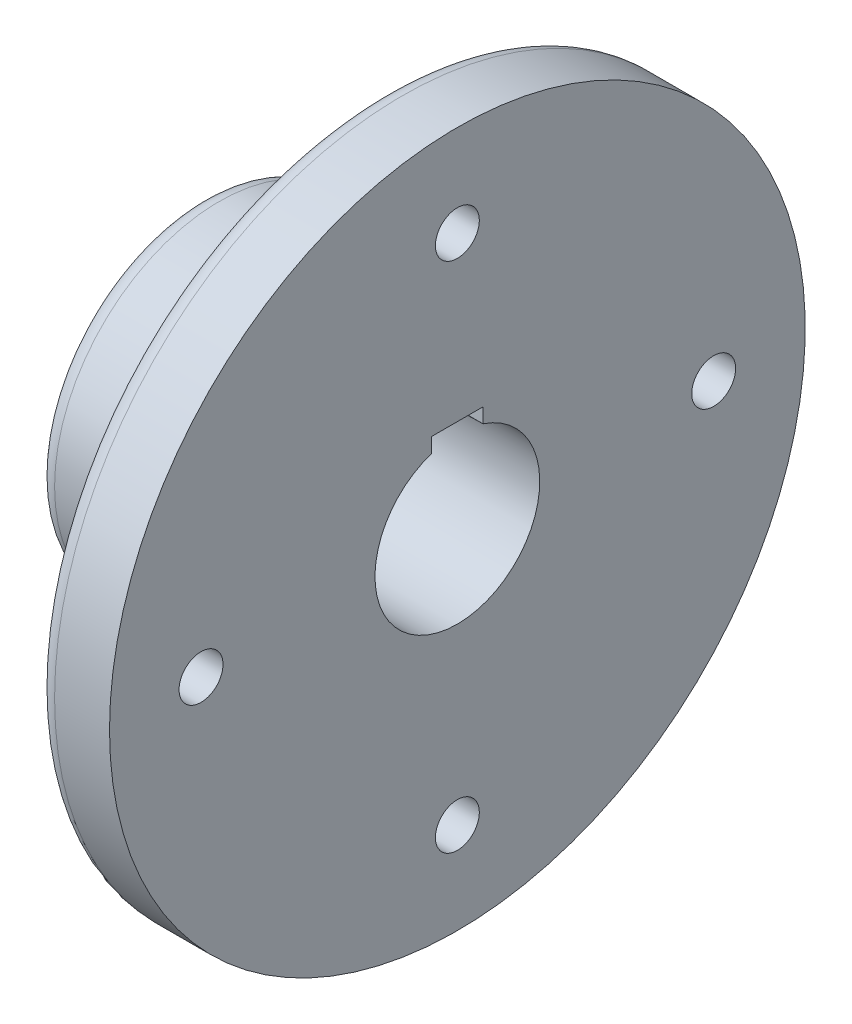
ISO-10303-21;
HEADER;
FILE_DESCRIPTION(('STEP AP214'),'2;1');
FILE_NAME('part.step','',(''),(''),'','','');
FILE_SCHEMA(('AUTOMOTIVE_DESIGN { 1 0 10303 214 1 1 1 1 }'));
ENDSEC;
DATA;
#1=APPLICATION_CONTEXT('core data for automotive mechanical design processes');
#2=APPLICATION_PROTOCOL_DEFINITION('international standard','automotive_design',2000,#1);
#3=PRODUCT_CONTEXT('',#1,'mechanical');
#4=PRODUCT('Part','Part','',(#3));
#5=PRODUCT_RELATED_PRODUCT_CATEGORY('part','',(#4));
#6=PRODUCT_DEFINITION_FORMATION('','',#4);
#7=PRODUCT_DEFINITION_CONTEXT('part definition',#1,'design');
#8=PRODUCT_DEFINITION('design','',#6,#7);
#9=PRODUCT_DEFINITION_SHAPE('','',#8);
#10=(LENGTH_UNIT() NAMED_UNIT(*) SI_UNIT(.MILLI.,.METRE.));
#11=(NAMED_UNIT(*) PLANE_ANGLE_UNIT() SI_UNIT($,.RADIAN.));
#12=(NAMED_UNIT(*) SI_UNIT($,.STERADIAN.) SOLID_ANGLE_UNIT());
#13=UNCERTAINTY_MEASURE_WITH_UNIT(LENGTH_MEASURE(1.E-05),#10,'distance_accuracy_value','');
#14=(GEOMETRIC_REPRESENTATION_CONTEXT(3) GLOBAL_UNCERTAINTY_ASSIGNED_CONTEXT((#13)) GLOBAL_UNIT_ASSIGNED_CONTEXT((#10,
#11,#12)) REPRESENTATION_CONTEXT('',''));
#15=CARTESIAN_POINT('',(0.,0.,0.));
#16=DIRECTION('',(0.,0.,1.));
#17=DIRECTION('',(1.,0.,0.));
#18=AXIS2_PLACEMENT_3D('',#15,#16,#17);
#19=CARTESIAN_POINT('',(0.,0.,0.));
#20=DIRECTION('',(1.,0.,0.));
#21=DIRECTION('',(0.,0.,-1.));
#22=AXIS2_PLACEMENT_3D('',#19,#20,#21);
#23=PLANE('',#22);
#24=DIRECTION('',(0.,-1.,0.));
#25=VECTOR('',#24,1.);
#26=CARTESIAN_POINT('',(0.,0.,-38.696409346288));
#27=LINE('',#26,#25);
#28=CARTESIAN_POINT('',(0.,24.703590653712,-38.696409346288));
#29=VERTEX_POINT('',#28);
#30=CARTESIAN_POINT('',(0.,21.9858428647257,-38.696409346288));
#31=VERTEX_POINT('',#30);
#32=EDGE_CURVE('E150',#29,#31,#27,.T.);
#33=ORIENTED_EDGE('',*,*,#32,.T.);
#34=DIRECTION('',(0.,0.00706473150833643,-0.999975044472968));
#35=VECTOR('',#34,1.);
#36=CARTESIAN_POINT('',(0.,21.7113726217935,0.153388846149928));
#37=LINE('',#36,#35);
#38=CARTESIAN_POINT('',(0.,21.9969517645523,-40.2688148347419));
#39=VERTEX_POINT('',#38);
#40=EDGE_CURVE('E148',#31,#39,#37,.T.);
#41=ORIENTED_EDGE('',*,*,#40,.T.);
#42=CARTESIAN_POINT('',(0.,0.,-45.));
#43=DIRECTION('',(-1.,0.,0.));
#44=DIRECTION('',(0.,0.,1.));
#45=AXIS2_PLACEMENT_3D('',#42,#43,#44);
#46=CIRCLE('',#45,22.5);
#47=CARTESIAN_POINT('',(0.,22.0616034474162,-49.4199155341426));
#48=VERTEX_POINT('',#47);
#49=EDGE_CURVE('E116',#48,#39,#46,.T.);
#50=ORIENTED_EDGE('',*,*,#49,.F.);
#51=CARTESIAN_POINT('',(0.,22.0749114384928,-51.303590653712));
#52=VERTEX_POINT('',#51);
#53=EDGE_CURVE('E61',#48,#52,#37,.T.);
#54=ORIENTED_EDGE('',*,*,#53,.T.);
#55=DIRECTION('',(0.,1.,0.));
#56=VECTOR('',#55,1.);
#57=CARTESIAN_POINT('',(0.,0.,-51.303590653712));
#58=LINE('',#57,#56);
#59=CARTESIAN_POINT('',(0.,24.703590653712,-51.303590653712));
#60=VERTEX_POINT('',#59);
#61=EDGE_CURVE('E100',#52,#60,#58,.T.);
#62=ORIENTED_EDGE('',*,*,#61,.T.);
#63=DIRECTION('',(0.,0.,1.));
#64=VECTOR('',#63,1.);
#65=CARTESIAN_POINT('',(0.,24.703590653712,0.));
#66=LINE('',#65,#64);
#67=EDGE_CURVE('E152',#60,#29,#66,.T.);
#68=ORIENTED_EDGE('',*,*,#67,.T.);
#69=EDGE_LOOP('',(#33,#41,#50,#54,#62,#68));
#70=FACE_BOUND('',#69,.T.);
#71=CARTESIAN_POINT('',(0.,0.,-45.));
#72=DIRECTION('',(-1.,0.,0.));
#73=DIRECTION('',(0.,0.,1.));
#74=AXIS2_PLACEMENT_3D('',#71,#72,#73);
#75=CIRCLE('',#74,40.);
#76=CARTESIAN_POINT('',(0.,0.,-5.00000000000003));
#77=VERTEX_POINT('',#76);
#78=EDGE_CURVE('E139',#77,#77,#75,.T.);
#79=ORIENTED_EDGE('',*,*,#78,.T.);
#80=EDGE_LOOP('',(#79));
#81=FACE_BOUND('',#80,.T.);
#82=ADVANCED_FACE('F39',(#70,#81),#23,.F.);
#83=CARTESIAN_POINT('',(4.99999999999999,0.,-45.));
#84=DIRECTION('',(-1.,0.,0.));
#85=DIRECTION('',(0.,0.,1.));
#86=AXIS2_PLACEMENT_3D('',#83,#84,#85);
#87=TOROIDAL_SURFACE('',#86,40.,5.);
#88=CARTESIAN_POINT('',(5.00000000000003,0.,-45.));
#89=DIRECTION('',(-1.,0.,0.));
#90=DIRECTION('',(0.,0.,1.));
#91=AXIS2_PLACEMENT_3D('',#88,#89,#90);
#92=CIRCLE('',#91,45.);
#93=CARTESIAN_POINT('',(5.00000000000004,0.,0.));
#94=VERTEX_POINT('',#93);
#95=EDGE_CURVE('E136',#94,#94,#92,.T.);
#96=ORIENTED_EDGE('',*,*,#95,.T.);
#97=EDGE_LOOP('',(#96));
#98=FACE_BOUND('',#97,.T.);
#99=ORIENTED_EDGE('',*,*,#78,.F.);
#100=EDGE_LOOP('',(#99));
#101=FACE_BOUND('',#100,.T.);
#102=ADVANCED_FACE('F207',(#98,#101),#87,.T.);
#103=CARTESIAN_POINT('',(0.,0.,-45.));
#104=DIRECTION('',(-1.,0.,0.));
#105=DIRECTION('',(0.,0.,1.));
#106=AXIS2_PLACEMENT_3D('',#103,#104,#105);
#107=CYLINDRICAL_SURFACE('',#106,45.);
#108=CARTESIAN_POINT('',(45.,0.,-45.));
#109=DIRECTION('',(-1.,0.,0.));
#110=DIRECTION('',(0.,0.,1.));
#111=AXIS2_PLACEMENT_3D('',#108,#109,#110);
#112=CIRCLE('',#111,45.);
#113=CARTESIAN_POINT('',(45.,0.,0.));
#114=VERTEX_POINT('',#113);
#115=EDGE_CURVE('E133',#114,#114,#112,.T.);
#116=ORIENTED_EDGE('',*,*,#115,.T.);
#117=EDGE_LOOP('',(#116));
#118=FACE_BOUND('',#117,.T.);
#119=ORIENTED_EDGE('',*,*,#95,.F.);
#120=EDGE_LOOP('',(#119));
#121=FACE_BOUND('',#120,.T.);
#122=ADVANCED_FACE('F201',(#118,#121),#107,.T.);
#123=CARTESIAN_POINT('',(45.,0.,-45.));
#124=DIRECTION('',(-1.,0.,0.));
#125=DIRECTION('',(0.,0.,1.));
#126=AXIS2_PLACEMENT_3D('',#123,#124,#125);
#127=TOROIDAL_SURFACE('',#126,50.,5.);
#128=CARTESIAN_POINT('',(50.,0.,-45.));
#129=DIRECTION('',(-1.,0.,0.));
#130=DIRECTION('',(0.,0.,1.));
#131=AXIS2_PLACEMENT_3D('',#128,#129,#130);
#132=CIRCLE('',#131,50.);
#133=CARTESIAN_POINT('',(50.,0.,5.00000000000003));
#134=VERTEX_POINT('',#133);
#135=EDGE_CURVE('E130',#134,#134,#132,.T.);
#136=ORIENTED_EDGE('',*,*,#135,.T.);
#137=EDGE_LOOP('',(#136));
#138=FACE_BOUND('',#137,.T.);
#139=ORIENTED_EDGE('',*,*,#115,.F.);
#140=EDGE_LOOP('',(#139));
#141=FACE_BOUND('',#140,.T.);
#142=ADVANCED_FACE('F187',(#138,#141),#127,.F.);
#143=CARTESIAN_POINT('',(50.,0.,0.));
#144=DIRECTION('',(-1.,0.,0.));
#145=DIRECTION('',(0.,0.,1.));
#146=AXIS2_PLACEMENT_3D('',#143,#144,#145);
#147=PLANE('',#146);
#148=CARTESIAN_POINT('',(50.,-70.,-45.));
#149=DIRECTION('',(-1.,0.,0.));
#150=DIRECTION('',(0.,0.,1.));
#151=AXIS2_PLACEMENT_3D('',#148,#149,#150);
#152=CIRCLE('',#151,6.);
#153=CARTESIAN_POINT('',(50.,-70.,-39.));
#154=VERTEX_POINT('',#153);
#155=EDGE_CURVE('E121',#154,#154,#152,.T.);
#156=ORIENTED_EDGE('',*,*,#155,.F.);
#157=EDGE_LOOP('',(#156));
#158=FACE_BOUND('',#157,.T.);
#159=CARTESIAN_POINT('',(50.,2.42861286636753E-13,25.));
#160=DIRECTION('',(-1.,0.,0.));
#161=DIRECTION('',(0.,0.,1.));
#162=AXIS2_PLACEMENT_3D('',#159,#160,#161);
#163=CIRCLE('',#162,6.);
#164=CARTESIAN_POINT('',(50.,2.42861286636753E-13,31.));
#165=VERTEX_POINT('',#164);
#166=EDGE_CURVE('E175',#165,#165,#163,.T.);
#167=ORIENTED_EDGE('',*,*,#166,.F.);
#168=EDGE_LOOP('',(#167));
#169=FACE_BOUND('',#168,.T.);
#170=CARTESIAN_POINT('',(50.,70.,-45.0000000000005));
#171=DIRECTION('',(-1.,0.,0.));
#172=DIRECTION('',(0.,0.,1.));
#173=AXIS2_PLACEMENT_3D('',#170,#171,#172);
#174=CIRCLE('',#173,6.);
#175=CARTESIAN_POINT('',(50.,70.,-39.0000000000005));
#176=VERTEX_POINT('',#175);
#177=EDGE_CURVE('E172',#176,#176,#174,.T.);
#178=ORIENTED_EDGE('',*,*,#177,.F.);
#179=EDGE_LOOP('',(#178));
#180=FACE_BOUND('',#179,.T.);
#181=CARTESIAN_POINT('',(50.,-7.49400541621981E-13,-115.));
#182=DIRECTION('',(-1.,0.,0.));
#183=DIRECTION('',(0.,0.,1.));
#184=AXIS2_PLACEMENT_3D('',#181,#182,#183);
#185=CIRCLE('',#184,6.00000000000001);
#186=CARTESIAN_POINT('',(50.,-7.49400541621981E-13,-109.));
#187=VERTEX_POINT('',#186);
#188=EDGE_CURVE('E159',#187,#187,#185,.T.);
#189=ORIENTED_EDGE('',*,*,#188,.F.);
#190=EDGE_LOOP('',(#189));
#191=FACE_BOUND('',#190,.T.);
#192=CARTESIAN_POINT('',(50.,0.,-45.));
#193=DIRECTION('',(-1.,0.,0.));
#194=DIRECTION('',(0.,0.,1.));
#195=AXIS2_PLACEMENT_3D('',#192,#193,#194);
#196=CIRCLE('',#195,90.);
#197=CARTESIAN_POINT('',(50.,0.,45.));
#198=VERTEX_POINT('',#197);
#199=EDGE_CURVE('E127',#198,#198,#196,.T.);
#200=ORIENTED_EDGE('',*,*,#199,.T.);
#201=EDGE_LOOP('',(#200));
#202=FACE_BOUND('',#201,.T.);
#203=ORIENTED_EDGE('',*,*,#135,.F.);
#204=EDGE_LOOP('',(#203));
#205=FACE_BOUND('',#204,.T.);
#206=ADVANCED_FACE('F183',(#158,#169,#180,#191,#202,#205),#147,.T.);
#207=CARTESIAN_POINT('',(55.,0.,-45.));
#208=DIRECTION('',(-1.,0.,0.));
#209=DIRECTION('',(0.,0.,1.));
#210=AXIS2_PLACEMENT_3D('',#207,#208,#209);
#211=TOROIDAL_SURFACE('',#210,90.,5.);
#212=CARTESIAN_POINT('',(55.,0.,-45.));
#213=DIRECTION('',(-1.,0.,0.));
#214=DIRECTION('',(0.,0.,1.));
#215=AXIS2_PLACEMENT_3D('',#212,#213,#214);
#216=CIRCLE('',#215,95.);
#217=CARTESIAN_POINT('',(55.,0.,50.));
#218=VERTEX_POINT('',#217);
#219=EDGE_CURVE('E119',#218,#218,#216,.T.);
#220=ORIENTED_EDGE('',*,*,#219,.T.);
#221=EDGE_LOOP('',(#220));
#222=FACE_BOUND('',#221,.T.);
#223=ORIENTED_EDGE('',*,*,#199,.F.);
#224=EDGE_LOOP('',(#223));
#225=FACE_BOUND('',#224,.T.);
#226=ADVANCED_FACE('F186',(#222,#225),#211,.T.);
#227=CARTESIAN_POINT('',(0.,0.,-45.));
#228=DIRECTION('',(-1.,0.,0.));
#229=DIRECTION('',(0.,0.,1.));
#230=AXIS2_PLACEMENT_3D('',#227,#228,#229);
#231=CYLINDRICAL_SURFACE('',#230,95.);
#232=ORIENTED_EDGE('',*,*,#219,.F.);
#233=EDGE_LOOP('',(#232));
#234=FACE_BOUND('',#233,.T.);
#235=CARTESIAN_POINT('',(70.,0.,-45.));
#236=DIRECTION('',(-1.,0.,0.));
#237=DIRECTION('',(0.,0.,1.));
#238=AXIS2_PLACEMENT_3D('',#235,#236,#237);
#239=CIRCLE('',#238,95.);
#240=CARTESIAN_POINT('',(70.,0.,50.));
#241=VERTEX_POINT('',#240);
#242=EDGE_CURVE('E115',#241,#241,#239,.T.);
#243=ORIENTED_EDGE('',*,*,#242,.T.);
#244=EDGE_LOOP('',(#243));
#245=FACE_BOUND('',#244,.T.);
#246=ADVANCED_FACE('F243',(#234,#245),#231,.T.);
#247=CARTESIAN_POINT('',(70.,0.,0.));
#248=DIRECTION('',(1.,0.,0.));
#249=DIRECTION('',(0.,0.,-1.));
#250=AXIS2_PLACEMENT_3D('',#247,#248,#249);
#251=PLANE('',#250);
#252=DIRECTION('',(0.,-1.,0.));
#253=VECTOR('',#252,1.);
#254=CARTESIAN_POINT('',(70.,25.4,-38.));
#255=LINE('',#254,#253);
#256=CARTESIAN_POINT('',(70.,25.4,-38.));
#257=VERTEX_POINT('',#256);
#258=CARTESIAN_POINT('',(70.,21.3834047803431,-38.));
#259=VERTEX_POINT('',#258);
#260=EDGE_CURVE('E144',#257,#259,#255,.T.);
#261=ORIENTED_EDGE('',*,*,#260,.F.);
#262=DIRECTION('',(0.,0.,1.));
#263=VECTOR('',#262,1.);
#264=CARTESIAN_POINT('',(70.,25.4,-45.));
#265=LINE('',#264,#263);
#266=CARTESIAN_POINT('',(70.,25.4,-52.));
#267=VERTEX_POINT('',#266);
#268=EDGE_CURVE('E110',#267,#257,#265,.T.);
#269=ORIENTED_EDGE('',*,*,#268,.F.);
#270=DIRECTION('',(0.,1.,0.));
#271=VECTOR('',#270,1.);
#272=CARTESIAN_POINT('',(70.,25.4,-52.));
#273=LINE('',#272,#271);
#274=CARTESIAN_POINT('',(70.,21.3834047803431,-52.));
#275=VERTEX_POINT('',#274);
#276=EDGE_CURVE('E97',#275,#267,#273,.T.);
#277=ORIENTED_EDGE('',*,*,#276,.F.);
#278=CARTESIAN_POINT('',(70.,0.,-45.));
#279=DIRECTION('',(-1.,0.,0.));
#280=DIRECTION('',(0.,0.,1.));
#281=AXIS2_PLACEMENT_3D('',#278,#279,#280);
#282=CIRCLE('',#281,22.5);
#283=EDGE_CURVE('E108',#275,#259,#282,.T.);
#284=ORIENTED_EDGE('',*,*,#283,.T.);
#285=EDGE_LOOP('',(#261,#269,#277,#284));
#286=FACE_BOUND('',#285,.T.);
#287=CARTESIAN_POINT('',(70.,-70.,-45.));
#288=DIRECTION('',(1.,0.,0.));
#289=DIRECTION('',(0.,0.,-1.));
#290=AXIS2_PLACEMENT_3D('',#287,#288,#289);
#291=CIRCLE('',#290,6.);
#292=CARTESIAN_POINT('',(70.,-70.,-51.));
#293=VERTEX_POINT('',#292);
#294=EDGE_CURVE('E156',#293,#293,#291,.T.);
#295=ORIENTED_EDGE('',*,*,#294,.F.);
#296=EDGE_LOOP('',(#295));
#297=FACE_BOUND('',#296,.T.);
#298=CARTESIAN_POINT('',(70.,2.42861286636753E-13,25.));
#299=DIRECTION('',(1.,0.,0.));
#300=DIRECTION('',(0.,0.,-1.));
#301=AXIS2_PLACEMENT_3D('',#298,#299,#300);
#302=CIRCLE('',#301,6.);
#303=CARTESIAN_POINT('',(70.,2.42861286636753E-13,19.));
#304=VERTEX_POINT('',#303);
#305=EDGE_CURVE('E160',#304,#304,#302,.T.);
#306=ORIENTED_EDGE('',*,*,#305,.F.);
#307=EDGE_LOOP('',(#306));
#308=FACE_BOUND('',#307,.T.);
#309=CARTESIAN_POINT('',(70.,70.,-45.0000000000005));
#310=DIRECTION('',(1.,0.,0.));
#311=DIRECTION('',(0.,0.,-1.));
#312=AXIS2_PLACEMENT_3D('',#309,#310,#311);
#313=CIRCLE('',#312,6.);
#314=CARTESIAN_POINT('',(70.,70.,-51.0000000000005));
#315=VERTEX_POINT('',#314);
#316=EDGE_CURVE('E163',#315,#315,#313,.T.);
#317=ORIENTED_EDGE('',*,*,#316,.F.);
#318=EDGE_LOOP('',(#317));
#319=FACE_BOUND('',#318,.T.);
#320=CARTESIAN_POINT('',(70.,-7.49400541621981E-13,-115.));
#321=DIRECTION('',(1.,0.,0.));
#322=DIRECTION('',(0.,0.,-1.));
#323=AXIS2_PLACEMENT_3D('',#320,#321,#322);
#324=CIRCLE('',#323,6.00000000000001);
#325=CARTESIAN_POINT('',(70.,-7.49400541621981E-13,-121.));
#326=VERTEX_POINT('',#325);
#327=EDGE_CURVE('E166',#326,#326,#324,.T.);
#328=ORIENTED_EDGE('',*,*,#327,.F.);
#329=EDGE_LOOP('',(#328));
#330=FACE_BOUND('',#329,.T.);
#331=ORIENTED_EDGE('',*,*,#242,.F.);
#332=EDGE_LOOP('',(#331));
#333=FACE_BOUND('',#332,.T.);
#334=ADVANCED_FACE('F106',(#286,#297,#308,#319,#330,#333),#251,.T.);
#335=CARTESIAN_POINT('',(0.,0.,-45.));
#336=DIRECTION('',(-1.,0.,0.));
#337=DIRECTION('',(0.,0.,1.));
#338=AXIS2_PLACEMENT_3D('',#335,#336,#337);
#339=CYLINDRICAL_SURFACE('',#338,22.5);
#340=CARTESIAN_POINT('',(2214.34121218386,0.,-45.0000000000004));
#341=DIRECTION('',(-0.00994821263837438,-0.999925561016168,-0.00706438191227568));
#342=DIRECTION('',(-0.999950515308284,0.00994796437548497,7.02814512781525E-05));
#343=AXIS2_PLACEMENT_3D('',#340,#341,#342);
#344=ELLIPSE('',#343,2261.71281393888,22.5);
#345=EDGE_CURVE('E11',#48,#275,#344,.T.);
#346=ORIENTED_EDGE('',*,*,#345,.F.);
#347=ORIENTED_EDGE('',*,*,#49,.T.);
#348=CARTESIAN_POINT('',(55.4538643366889,21.4302372939061,-38.1447152118329));
#349=VERTEX_POINT('',#348);
#350=EDGE_CURVE('E47',#349,#39,#344,.T.);
#351=ORIENTED_EDGE('',*,*,#350,.F.);
#352=CARTESIAN_POINT('',(-633.609166953008,0.,-44.9999999999999));
#353=DIRECTION('',(-0.00994821263837418,0.,0.999950515308283));
#354=DIRECTION('',(-0.999950515308284,0.,-0.00994821263837418));
#355=AXIS2_PLACEMENT_3D('',#352,#353,#354);
#356=ELLIPSE('',#355,2261.71281393888,22.5);
#357=EDGE_CURVE('E42',#259,#349,#356,.T.);
#358=ORIENTED_EDGE('',*,*,#357,.F.);
#359=ORIENTED_EDGE('',*,*,#283,.F.);
#360=EDGE_LOOP('',(#346,#347,#351,#358,#359));
#361=FACE_BOUND('',#360,.T.);
#362=ADVANCED_FACE('F113',(#361),#339,.F.);
#363=CARTESIAN_POINT('',(0.,-7.49400541621981E-13,-115.));
#364=DIRECTION('',(1.,0.,0.));
#365=DIRECTION('',(0.,0.,-1.));
#366=AXIS2_PLACEMENT_3D('',#363,#364,#365);
#367=CYLINDRICAL_SURFACE('',#366,6.00000000000001);
#368=ORIENTED_EDGE('',*,*,#188,.T.);
#369=EDGE_LOOP('',(#368));
#370=FACE_BOUND('',#369,.T.);
#371=ORIENTED_EDGE('',*,*,#327,.T.);
#372=EDGE_LOOP('',(#371));
#373=FACE_BOUND('',#372,.T.);
#374=ADVANCED_FACE('F262',(#370,#373),#367,.F.);
#375=CARTESIAN_POINT('',(0.,70.,-45.0000000000005));
#376=DIRECTION('',(1.,0.,0.));
#377=DIRECTION('',(0.,0.,-1.));
#378=AXIS2_PLACEMENT_3D('',#375,#376,#377);
#379=CYLINDRICAL_SURFACE('',#378,6.);
#380=ORIENTED_EDGE('',*,*,#177,.T.);
#381=EDGE_LOOP('',(#380));
#382=FACE_BOUND('',#381,.T.);
#383=ORIENTED_EDGE('',*,*,#316,.T.);
#384=EDGE_LOOP('',(#383));
#385=FACE_BOUND('',#384,.T.);
#386=ADVANCED_FACE('F269',(#382,#385),#379,.F.);
#387=CARTESIAN_POINT('',(0.,2.42861286636753E-13,25.));
#388=DIRECTION('',(1.,0.,0.));
#389=DIRECTION('',(0.,0.,-1.));
#390=AXIS2_PLACEMENT_3D('',#387,#388,#389);
#391=CYLINDRICAL_SURFACE('',#390,6.);
#392=ORIENTED_EDGE('',*,*,#166,.T.);
#393=EDGE_LOOP('',(#392));
#394=FACE_BOUND('',#393,.T.);
#395=ORIENTED_EDGE('',*,*,#305,.T.);
#396=EDGE_LOOP('',(#395));
#397=FACE_BOUND('',#396,.T.);
#398=ADVANCED_FACE('F277',(#394,#397),#391,.F.);
#399=CARTESIAN_POINT('',(0.,-70.,-45.));
#400=DIRECTION('',(1.,0.,0.));
#401=DIRECTION('',(0.,0.,-1.));
#402=AXIS2_PLACEMENT_3D('',#399,#400,#401);
#403=CYLINDRICAL_SURFACE('',#402,6.);
#404=ORIENTED_EDGE('',*,*,#155,.T.);
#405=EDGE_LOOP('',(#404));
#406=FACE_BOUND('',#405,.T.);
#407=ORIENTED_EDGE('',*,*,#294,.T.);
#408=EDGE_LOOP('',(#407));
#409=FACE_BOUND('',#408,.T.);
#410=ADVANCED_FACE('F180',(#406,#409),#403,.F.);
#411=CARTESIAN_POINT('',(70.,21.2844960709074,-38.));
#412=DIRECTION('',(-0.00994821263837438,-0.999925561016168,-0.00706438191227568));
#413=DIRECTION('',(0.999950512838541,-0.00994846088288813,0.));
#414=AXIS2_PLACEMENT_3D('',#411,#412,#413);
#415=PLANE('',#414);
#416=ORIENTED_EDGE('',*,*,#345,.T.);
#417=DIRECTION('',(0.999901732095355,-0.00987769578913358,-0.00994772730858279));
#418=VECTOR('',#417,1.);
#419=CARTESIAN_POINT('',(69.8617223974082,21.3847707786698,-51.998624316931));
#420=LINE('',#419,#418);
#421=EDGE_CURVE('E87',#52,#275,#420,.T.);
#422=ORIENTED_EDGE('',*,*,#421,.F.);
#423=ORIENTED_EDGE('',*,*,#53,.F.);
#424=EDGE_LOOP('',(#416,#422,#423));
#425=FACE_BOUND('',#424,.T.);
#426=ADVANCED_FACE('F86',(#425),#415,.F.);
#427=CARTESIAN_POINT('',(70.,25.4,-38.));
#428=DIRECTION('',(-0.00994821263837418,0.,0.999950515308283));
#429=DIRECTION('',(0.999950515308283,0.,0.00994821263837418));
#430=AXIS2_PLACEMENT_3D('',#427,#428,#429);
#431=PLANE('',#430);
#432=ORIENTED_EDGE('',*,*,#357,.T.);
#433=DIRECTION('',(0.999900333952697,-0.0100182413336511,0.00994771339887361));
#434=VECTOR('',#433,1.);
#435=CARTESIAN_POINT('',(69.958773997671,21.2849091241154,-38.0004101453333));
#436=LINE('',#435,#434);
#437=EDGE_CURVE('E54',#31,#349,#436,.T.);
#438=ORIENTED_EDGE('',*,*,#437,.F.);
#439=ORIENTED_EDGE('',*,*,#32,.F.);
#440=DIRECTION('',(0.999901037962044,0.00994772040285509,0.00994772040285489));
#441=VECTOR('',#440,1.);
#442=CARTESIAN_POINT('',(69.9303728483068,25.3993073000115,-38.0006926999885));
#443=LINE('',#442,#441);
#444=EDGE_CURVE('E169',#29,#257,#443,.T.);
#445=ORIENTED_EDGE('',*,*,#444,.T.);
#446=ORIENTED_EDGE('',*,*,#260,.T.);
#447=EDGE_LOOP('',(#432,#438,#439,#445,#446));
#448=FACE_BOUND('',#447,.T.);
#449=ADVANCED_FACE('F143',(#448),#431,.F.);
#450=CARTESIAN_POINT('',(70.,25.4,-45.));
#451=DIRECTION('',(-0.00994821263837438,0.999950515308283,0.));
#452=DIRECTION('',(-0.999950515308284,-0.00994821263837438,0.));
#453=AXIS2_PLACEMENT_3D('',#450,#451,#452);
#454=PLANE('',#453);
#455=ORIENTED_EDGE('',*,*,#268,.T.);
#456=ORIENTED_EDGE('',*,*,#444,.F.);
#457=ORIENTED_EDGE('',*,*,#67,.F.);
#458=DIRECTION('',(0.999901037962044,0.00994772040285509,-0.00994772040285528));
#459=VECTOR('',#458,1.);
#460=CARTESIAN_POINT('',(70.,25.4,-52.));
#461=LINE('',#460,#459);
#462=EDGE_CURVE('E101',#60,#267,#461,.T.);
#463=ORIENTED_EDGE('',*,*,#462,.T.);
#464=EDGE_LOOP('',(#455,#456,#457,#463));
#465=FACE_BOUND('',#464,.T.);
#466=ADVANCED_FACE('F303',(#465),#454,.F.);
#467=CARTESIAN_POINT('',(70.,25.4,-52.));
#468=DIRECTION('',(-0.00994821263837458,0.,-0.999950515308283));
#469=DIRECTION('',(-0.999950515308283,0.,0.00994821263837458));
#470=AXIS2_PLACEMENT_3D('',#467,#468,#469);
#471=PLANE('',#470);
#472=ORIENTED_EDGE('',*,*,#276,.T.);
#473=ORIENTED_EDGE('',*,*,#462,.F.);
#474=ORIENTED_EDGE('',*,*,#61,.F.);
#475=ORIENTED_EDGE('',*,*,#421,.T.);
#476=EDGE_LOOP('',(#472,#473,#474,#475));
#477=FACE_BOUND('',#476,.T.);
#478=ADVANCED_FACE('F96',(#477),#471,.F.);
#479=ORIENTED_EDGE('',*,*,#350,.T.);
#480=ORIENTED_EDGE('',*,*,#40,.F.);
#481=ORIENTED_EDGE('',*,*,#437,.T.);
#482=EDGE_LOOP('',(#479,#480,#481));
#483=FACE_BOUND('',#482,.T.);
#484=ADVANCED_FACE('F297',(#483),#415,.F.);
#485=CLOSED_SHELL('',(#82,#102,#122,#142,#206,#226,#246,#334,#362,#374,#386,#398,#410,#426,#449,
#466,#478,#484));
#486=MANIFOLD_SOLID_BREP('B2',#485);
#487=ADVANCED_BREP_SHAPE_REPRESENTATION('',(#18,#486),#14);
#488=SHAPE_DEFINITION_REPRESENTATION(#9,#487);
ENDSEC;
END-ISO-10303-21;
